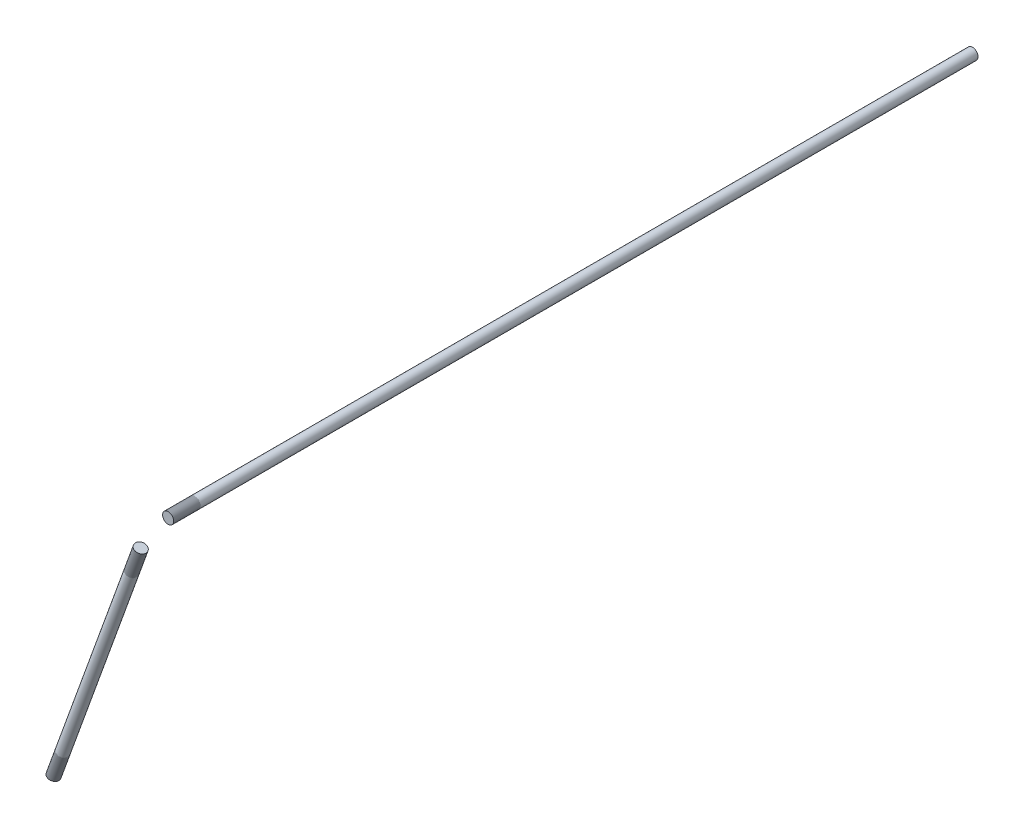
ISO-10303-21;
HEADER;
FILE_DESCRIPTION(('STEP AP214'),'2;1');
FILE_NAME('part.step','',(''),(''),'','','');
FILE_SCHEMA(('AUTOMOTIVE_DESIGN { 1 0 10303 214 1 1 1 1 }'));
ENDSEC;
DATA;
#1=APPLICATION_CONTEXT('core data for automotive mechanical design processes');
#2=APPLICATION_PROTOCOL_DEFINITION('international standard','automotive_design',2000,#1);
#3=PRODUCT_CONTEXT('',#1,'mechanical');
#4=PRODUCT('Part','Part','',(#3));
#5=PRODUCT_RELATED_PRODUCT_CATEGORY('part','',(#4));
#6=PRODUCT_DEFINITION_FORMATION('','',#4);
#7=PRODUCT_DEFINITION_CONTEXT('part definition',#1,'design');
#8=PRODUCT_DEFINITION('design','',#6,#7);
#9=PRODUCT_DEFINITION_SHAPE('','',#8);
#10=(LENGTH_UNIT() NAMED_UNIT(*) SI_UNIT(.MILLI.,.METRE.));
#11=(NAMED_UNIT(*) PLANE_ANGLE_UNIT() SI_UNIT($,.RADIAN.));
#12=(NAMED_UNIT(*) SI_UNIT($,.STERADIAN.) SOLID_ANGLE_UNIT());
#13=UNCERTAINTY_MEASURE_WITH_UNIT(LENGTH_MEASURE(1.E-05),#10,'distance_accuracy_value','');
#14=(GEOMETRIC_REPRESENTATION_CONTEXT(3) GLOBAL_UNCERTAINTY_ASSIGNED_CONTEXT((#13)) GLOBAL_UNIT_ASSIGNED_CONTEXT((#10,
#11,#12)) REPRESENTATION_CONTEXT('',''));
#15=CARTESIAN_POINT('',(0.,0.,0.));
#16=DIRECTION('',(0.,0.,1.));
#17=DIRECTION('',(1.,0.,0.));
#18=AXIS2_PLACEMENT_3D('',#15,#16,#17);
#19=CARTESIAN_POINT('',(-53.7637423435528,-148.467494196321,-8.21634173159548E-13));
#20=DIRECTION('',(-0.340487388896367,-0.940249082957561,0.));
#21=DIRECTION('',(0.940249082957561,-0.340487388896367,0.));
#22=AXIS2_PLACEMENT_3D('',#19,#20,#21);
#23=PLANE('',#22);
#24=CARTESIAN_POINT('',(-53.7637423435593,-148.467494196321,456.160294763652));
#25=DIRECTION('',(-0.340487388896367,-0.940249082957561,0.));
#26=DIRECTION('',(0.940249082957561,-0.340487388896367,0.));
#27=AXIS2_PLACEMENT_3D('',#24,#25,#26);
#28=CIRCLE('',#27,3.17499999999998);
#29=CARTESIAN_POINT('',(-50.7784515051691,-149.548541656067,456.160294763652));
#30=VERTEX_POINT('',#29);
#31=EDGE_CURVE('E11',#30,#30,#28,.F.);
#32=ORIENTED_EDGE('',*,*,#31,.F.);
#33=EDGE_LOOP('',(#32));
#34=FACE_BOUND('',#33,.T.);
#35=ADVANCED_FACE('F44',(#34),#23,.T.);
#36=CARTESIAN_POINT('',(-3.978254651872,-10.9858702852756,456.160294763653));
#37=DIRECTION('',(0.340487388896365,0.940249082957561,0.));
#38=DIRECTION('',(-0.940249082957561,0.340487388896365,0.));
#39=AXIS2_PLACEMENT_3D('',#36,#37,#38);
#40=PLANE('',#39);
#41=CARTESIAN_POINT('',(-3.978254651872,-10.9858702852756,456.160294763653));
#42=DIRECTION('',(0.340487388896365,0.940249082957561,0.));
#43=DIRECTION('',(-0.940249082957561,0.340487388896365,0.));
#44=AXIS2_PLACEMENT_3D('',#41,#42,#43);
#45=CIRCLE('',#44,3.17499999999998);
#46=CARTESIAN_POINT('',(-6.96354549026225,-9.90482282552968,456.160294763653));
#47=VERTEX_POINT('',#46);
#48=EDGE_CURVE('E50',#47,#47,#45,.T.);
#49=ORIENTED_EDGE('',*,*,#48,.T.);
#50=EDGE_LOOP('',(#49));
#51=FACE_BOUND('',#50,.T.);
#52=ADVANCED_FACE('F56',(#51),#40,.T.);
#53=CARTESIAN_POINT('',(-56.8214063018427,-156.91117177888,456.160294763652));
#54=DIRECTION('',(0.340487388896365,0.940249082957561,0.));
#55=DIRECTION('',(-0.940249082957561,0.340487388896365,0.));
#56=AXIS2_PLACEMENT_3D('',#53,#54,#55);
#57=CYLINDRICAL_SURFACE('',#56,3.17499999999998);
#58=ORIENTED_EDGE('',*,*,#48,.F.);
#59=EDGE_LOOP('',(#58));
#60=FACE_BOUND('',#59,.T.);
#61=ORIENTED_EDGE('',*,*,#31,.T.);
#62=EDGE_LOOP('',(#61));
#63=FACE_BOUND('',#62,.T.);
#64=ADVANCED_FACE('F58',(#60,#63),#57,.T.);
#65=CLOSED_SHELL('',(#35,#52,#64));
#66=MANIFOLD_SOLID_BREP('B2',#65);
#67=CARTESIAN_POINT('',(-9.1335169643512E-12,3.30747181677705E-12,444.476294763653));
#68=DIRECTION('',(0.,0.,1.));
#69=DIRECTION('',(1.,0.,0.));
#70=AXIS2_PLACEMENT_3D('',#67,#68,#69);
#71=PLANE('',#70);
#72=CARTESIAN_POINT('',(-3.23951446827215E-13,1.91282277543247E-13,444.476294763653));
#73=DIRECTION('',(0.,0.,1.));
#74=DIRECTION('',(1.,0.,0.));
#75=AXIS2_PLACEMENT_3D('',#72,#73,#74);
#76=CIRCLE('',#75,3.17499999999998);
#77=CARTESIAN_POINT('',(-3.1750000000003,1.91282277543247E-13,444.476294763653));
#78=VERTEX_POINT('',#77);
#79=EDGE_CURVE('E43',#78,#78,#76,.F.);
#80=ORIENTED_EDGE('',*,*,#79,.F.);
#81=EDGE_LOOP('',(#80));
#82=FACE_BOUND('',#81,.T.);
#83=ADVANCED_FACE('F93',(#82),#71,.T.);
#84=CARTESIAN_POINT('',(0.,0.,-15.24));
#85=DIRECTION('',(0.,0.,-1.));
#86=DIRECTION('',(-1.,0.,0.));
#87=AXIS2_PLACEMENT_3D('',#84,#85,#86);
#88=PLANE('',#87);
#89=CARTESIAN_POINT('',(0.,0.,-15.24));
#90=DIRECTION('',(0.,0.,-1.));
#91=DIRECTION('',(-1.,0.,0.));
#92=AXIS2_PLACEMENT_3D('',#89,#90,#91);
#93=CIRCLE('',#92,3.17499999999998);
#94=CARTESIAN_POINT('',(-3.17500000000001,0.,-15.24));
#95=VERTEX_POINT('',#94);
#96=EDGE_CURVE('E99',#95,#95,#93,.T.);
#97=ORIENTED_EDGE('',*,*,#96,.T.);
#98=EDGE_LOOP('',(#97));
#99=FACE_BOUND('',#98,.T.);
#100=ADVANCED_FACE('F105',(#99),#88,.T.);
#101=CARTESIAN_POINT('',(-3.296757422495E-13,1.94348864376614E-13,453.456550884722));
#102=DIRECTION('',(0.,0.,-1.));
#103=DIRECTION('',(-1.,0.,0.));
#104=AXIS2_PLACEMENT_3D('',#101,#102,#103);
#105=CYLINDRICAL_SURFACE('',#104,3.17499999999998);
#106=CARTESIAN_POINT('',(-3.17500000000001,0.,-15.24));
#107=CARTESIAN_POINT('',(-3.17500000000001,0.,-10.451288596212));
#108=CARTESIAN_POINT('',(-3.17500000000001,0.,-5.66257719242392));
#109=CARTESIAN_POINT('',(-3.17500000000002,0.,3.91484561515219));
#110=CARTESIAN_POINT('',(-3.17500000000002,0.,8.70355701894023));
#111=CARTESIAN_POINT('',(-3.17500000000003,0.,18.2809798265163));
#112=CARTESIAN_POINT('',(-3.17500000000003,0.,23.0696912303044));
#113=CARTESIAN_POINT('',(-3.17500000000004,0.,32.6471140378805));
#114=CARTESIAN_POINT('',(-3.17500000000004,0.,37.4358254416685));
#115=CARTESIAN_POINT('',(-3.17500000000005,0.,47.0132482492446));
#116=CARTESIAN_POINT('',(-3.17500000000005,0.,51.8019596530327));
#117=CARTESIAN_POINT('',(-3.17500000000006,0.,61.3793824606088));
#118=CARTESIAN_POINT('',(-3.17500000000006,0.,66.1680938643969));
#119=CARTESIAN_POINT('',(-3.17500000000007,0.,75.745516671973));
#120=CARTESIAN_POINT('',(-3.17500000000007,0.,80.534228075761));
#121=CARTESIAN_POINT('',(-3.17500000000007,0.,90.1116508833371));
#122=CARTESIAN_POINT('',(-3.17500000000008,0.,94.9003622871252));
#123=CARTESIAN_POINT('',(-3.17500000000008,0.,104.477785094701));
#124=CARTESIAN_POINT('',(-3.17500000000009,0.,109.266496498489));
#125=CARTESIAN_POINT('',(-3.17500000000009,0.,118.843919306065));
#126=CARTESIAN_POINT('',(-3.1750000000001,0.,123.632630709853));
#127=CARTESIAN_POINT('',(-3.1750000000001,0.,133.21005351743));
#128=CARTESIAN_POINT('',(-3.1750000000001,0.,137.998764921218));
#129=CARTESIAN_POINT('',(-3.17500000000011,0.,147.576187728794));
#130=CARTESIAN_POINT('',(-3.17500000000011,0.,152.364899132582));
#131=CARTESIAN_POINT('',(-3.17500000000012,0.,161.942321940158));
#132=CARTESIAN_POINT('',(-3.17500000000012,0.,166.731033343946));
#133=CARTESIAN_POINT('',(-3.17500000000013,0.,176.308456151522));
#134=CARTESIAN_POINT('',(-3.17500000000013,1.01343310013602E-13,181.09716755531));
#135=CARTESIAN_POINT('',(-3.17500000000014,1.04613817923771E-13,190.674590362886));
#136=CARTESIAN_POINT('',(-3.17500000000014,1.06249071878856E-13,195.463301766674));
#137=CARTESIAN_POINT('',(-3.17500000000015,1.09519579789025E-13,205.04072457425));
#138=CARTESIAN_POINT('',(-3.17500000000015,1.11154833744109E-13,209.829435978038));
#139=CARTESIAN_POINT('',(-3.17500000000016,1.14425341654278E-13,219.406858785615));
#140=CARTESIAN_POINT('',(-3.17500000000016,1.16060595609362E-13,224.195570189403));
#141=CARTESIAN_POINT('',(-3.17500000000017,1.19331103519531E-13,233.772992996979));
#142=CARTESIAN_POINT('',(-3.17500000000017,1.20966357474616E-13,238.561704400767));
#143=CARTESIAN_POINT('',(-3.17500000000018,1.24236865384785E-13,248.139127208343));
#144=CARTESIAN_POINT('',(-3.17500000000018,1.25872119339869E-13,252.927838612131));
#145=CARTESIAN_POINT('',(-3.17500000000018,1.29142627250038E-13,262.505261419707));
#146=CARTESIAN_POINT('',(-3.17500000000019,1.30777881205122E-13,267.293972823495));
#147=CARTESIAN_POINT('',(-3.17500000000019,1.34048389115291E-13,276.871395631071));
#148=CARTESIAN_POINT('',(-3.1750000000002,1.35683643070376E-13,281.660107034859));
#149=CARTESIAN_POINT('',(-3.1750000000002,1.38954150980545E-13,291.237529842435));
#150=CARTESIAN_POINT('',(-3.17500000000021,1.40589404935629E-13,296.026241246223));
#151=CARTESIAN_POINT('',(-3.17500000000021,1.43859912845798E-13,305.603664053799));
#152=CARTESIAN_POINT('',(-3.17500000000021,1.45495166800882E-13,310.392375457588));
#153=CARTESIAN_POINT('',(-3.17500000000022,1.48765674711051E-13,319.969798265164));
#154=CARTESIAN_POINT('',(-3.17500000000022,1.50400928666136E-13,324.758509668952));
#155=CARTESIAN_POINT('',(-3.17500000000023,1.53671436576305E-13,334.335932476528));
#156=CARTESIAN_POINT('',(-3.17500000000023,1.55306690531389E-13,339.124643880316));
#157=CARTESIAN_POINT('',(-3.17500000000024,1.58577198441558E-13,348.702066687892));
#158=CARTESIAN_POINT('',(-3.17500000000024,1.60212452396642E-13,353.49077809168));
#159=CARTESIAN_POINT('',(-3.17500000000025,1.63482960306811E-13,363.068200899256));
#160=CARTESIAN_POINT('',(-3.17500000000025,1.65118214261896E-13,367.856912303044));
#161=CARTESIAN_POINT('',(-3.17500000000026,1.68388722172065E-13,377.43433511062));
#162=CARTESIAN_POINT('',(-3.17500000000026,1.70023976127149E-13,382.223046514408));
#163=CARTESIAN_POINT('',(-3.17500000000027,1.73294484037318E-13,391.800469321984));
#164=CARTESIAN_POINT('',(-3.17500000000027,1.74929737992402E-13,396.589180725772));
#165=CARTESIAN_POINT('',(-3.17500000000028,1.78200245902571E-13,406.166603533349));
#166=CARTESIAN_POINT('',(-3.17500000000028,1.79835499857656E-13,410.955314937137));
#167=CARTESIAN_POINT('',(-3.17500000000029,1.83106007767825E-13,420.532737744713));
#168=CARTESIAN_POINT('',(-3.17500000000029,1.84741261722909E-13,425.321449148501));
#169=CARTESIAN_POINT('',(-3.17500000000029,1.88011769633078E-13,434.898871956077));
#170=CARTESIAN_POINT('',(-3.1750000000003,1.89647023588162E-13,439.687583359865));
#171=CARTESIAN_POINT('',(-3.1750000000003,1.91282277543247E-13,444.476294763653));
#172=B_SPLINE_CURVE_WITH_KNOTS('',3,(#106,#107,#108,#109,#110,#111,#112,#113,#114,#115,#116,
#117,#118,#119,#120,#121,#122,#123,#124,#125,#126,#127,#128,#129,#130,#131,#132,#133,#134,#135,
#136,#137,#138,#139,#140,#141,#142,#143,#144,#145,#146,#147,#148,#149,#150,#151,#152,#153,#154,
#155,#156,#157,#158,#159,#160,#161,#162,#163,#164,#165,#166,#167,#168,#169,#170,#171),
.UNSPECIFIED.,.F.,.F.,(4,2,2,2,2,2,2,2,2,2,2,2,2,2,2,2,2,2,2,2,2,2,2,2,2,2,2,2,2,2,2,2,4),(0.,
14.3661342113642,28.7322684227283,43.0984026340925,57.4645368454566,71.8306710568208,
86.196805268185,100.562939479549,114.929073690913,129.295207902277,143.661342113642,
158.027476325006,172.39361053637,186.759744747734,201.125878959098,215.492013170462,
229.858147381827,244.224281593191,258.590415804555,272.956550015919,287.322684227283,
301.688818438647,316.054952650012,330.421086861376,344.78722107274,359.153355284104,
373.519489495468,387.885623706832,402.251757918196,416.617892129561,430.984026340925,
445.350160552289,459.716294763653),.UNSPECIFIED.);
#173=EDGE_CURVE('BSEAM107',#95,#78,#172,.T.);
#174=ORIENTED_EDGE('',*,*,#96,.F.);
#175=ORIENTED_EDGE('',*,*,#79,.T.);
#176=ORIENTED_EDGE('',*,*,#173,.T.);
#177=ORIENTED_EDGE('',*,*,#173,.F.);
#178=EDGE_LOOP('',(#174,#176,#175,#177));
#179=FACE_BOUND('',#178,.T.);
#180=ADVANCED_FACE('F107',(#179),#105,.T.);
#181=CLOSED_SHELL('',(#83,#100,#180));
#182=MANIFOLD_SOLID_BREP('B6',#181);
#183=CARTESIAN_POINT('',(-51.1692284401681,-141.302796184185,456.160294763653));
#184=DIRECTION('',(-0.340487388896365,-0.940249082957562,0.));
#185=DIRECTION('',(0.,0.,-1.));
#186=AXIS2_PLACEMENT_3D('',#183,#184,#185);
#187=CYLINDRICAL_SURFACE('',#186,3.175);
#188=CARTESIAN_POINT('',(-48.5747145367778,-134.138098172048,456.160294763653));
#189=DIRECTION('',(-0.340487388896365,-0.940249082957562,0.));
#190=DIRECTION('',(0.,0.,-1.));
#191=AXIS2_PLACEMENT_3D('',#188,#189,#190);
#192=CIRCLE('',#191,3.175);
#193=CARTESIAN_POINT('',(-48.5747145367778,-134.138098172048,452.985294763653));
#194=VERTEX_POINT('',#193);
#195=EDGE_CURVE('E146',#194,#194,#192,.T.);
#196=ORIENTED_EDGE('',*,*,#195,.F.);
#197=EDGE_LOOP('',(#196));
#198=FACE_BOUND('',#197,.T.);
#199=CARTESIAN_POINT('',(-53.7637423435584,-148.467494196321,456.160294763653));
#200=DIRECTION('',(-0.340487388896365,-0.940249082957562,0.));
#201=DIRECTION('',(0.,0.,-1.));
#202=AXIS2_PLACEMENT_3D('',#199,#200,#201);
#203=CIRCLE('',#202,3.175);
#204=CARTESIAN_POINT('',(-53.7637423435584,-148.467494196321,452.985294763653));
#205=VERTEX_POINT('',#204);
#206=EDGE_CURVE('E92',#205,#205,#203,.F.);
#207=ORIENTED_EDGE('',*,*,#206,.F.);
#208=EDGE_LOOP('',(#207));
#209=FACE_BOUND('',#208,.T.);
#210=ADVANCED_FACE('F142',(#198,#209),#187,.F.);
#211=OPEN_SHELL('',(#210));
#212=SHELL_BASED_SURFACE_MODEL('B38',(#211));
#213=CARTESIAN_POINT('',(-6.55403770319105E-12,5.88203118828181E-13,436.856294763653));
#214=DIRECTION('',(0.,0.,1.));
#215=DIRECTION('',(-0.340487388896365,-0.940249082957562,0.));
#216=AXIS2_PLACEMENT_3D('',#213,#214,#215);
#217=CYLINDRICAL_SURFACE('',#216,3.175);
#218=CARTESIAN_POINT('',(-6.43929354282591E-12,5.82867087928207E-13,429.236294763653));
#219=DIRECTION('',(0.,0.,1.));
#220=DIRECTION('',(-0.340487388896365,-0.940249082957562,0.));
#221=AXIS2_PLACEMENT_3D('',#218,#219,#220);
#222=CIRCLE('',#221,3.175);
#223=CARTESIAN_POINT('',(-1.0810474597524,-2.98529083838968,429.236294763653));
#224=VERTEX_POINT('',#223);
#225=EDGE_CURVE('E194',#224,#224,#222,.T.);
#226=ORIENTED_EDGE('',*,*,#225,.F.);
#227=EDGE_LOOP('',(#226));
#228=FACE_BOUND('',#227,.T.);
#229=CARTESIAN_POINT('',(-6.6687818635562E-12,5.93539149728155E-13,444.476294763653));
#230=DIRECTION('',(0.,0.,1.));
#231=DIRECTION('',(-0.340487388896365,-0.940249082957562,0.));
#232=AXIS2_PLACEMENT_3D('',#229,#230,#231);
#233=CIRCLE('',#232,3.175);
#234=CARTESIAN_POINT('',(-1.08104745975263,-2.98529083838966,444.476294763653));
#235=VERTEX_POINT('',#234);
#236=EDGE_CURVE('E141',#235,#235,#233,.F.);
#237=ORIENTED_EDGE('',*,*,#236,.F.);
#238=EDGE_LOOP('',(#237));
#239=FACE_BOUND('',#238,.T.);
#240=ADVANCED_FACE('F190',(#228,#239),#217,.F.);
#241=OPEN_SHELL('',(#240));
#242=SHELL_BASED_SURFACE_MODEL('B87',(#241));
#243=CARTESIAN_POINT('',(-6.57276855526228,-18.1505682974122,456.160294763653));
#244=DIRECTION('',(0.340487388896365,0.940249082957562,0.));
#245=DIRECTION('',(0.,0.,1.));
#246=AXIS2_PLACEMENT_3D('',#243,#244,#245);
#247=CYLINDRICAL_SURFACE('',#246,3.175);
#248=CARTESIAN_POINT('',(-9.16728245865258,-25.3152663095488,456.160294763653));
#249=DIRECTION('',(0.340487388896365,0.940249082957562,0.));
#250=DIRECTION('',(0.,0.,1.));
#251=AXIS2_PLACEMENT_3D('',#248,#249,#250);
#252=CIRCLE('',#251,3.175);
#253=CARTESIAN_POINT('',(-9.16728245865263,-25.3152663095488,459.335294763653));
#254=VERTEX_POINT('',#253);
#255=EDGE_CURVE('E189',#254,#254,#252,.T.);
#256=ORIENTED_EDGE('',*,*,#255,.F.);
#257=EDGE_LOOP('',(#256));
#258=FACE_BOUND('',#257,.T.);
#259=CARTESIAN_POINT('',(-3.97825465187198,-10.9858702852755,456.160294763653));
#260=DIRECTION('',(0.340487388896365,0.940249082957562,0.));
#261=DIRECTION('',(0.,0.,1.));
#262=AXIS2_PLACEMENT_3D('',#259,#260,#261);
#263=CIRCLE('',#262,3.175);
#264=CARTESIAN_POINT('',(-3.97825465187202,-10.9858702852755,459.335294763653));
#265=VERTEX_POINT('',#264);
#266=EDGE_CURVE('E241',#265,#265,#263,.F.);
#267=ORIENTED_EDGE('',*,*,#266,.F.);
#268=EDGE_LOOP('',(#267));
#269=FACE_BOUND('',#268,.T.);
#270=ADVANCED_FACE('F237',(#258,#269),#247,.F.);
#271=OPEN_SHELL('',(#270));
#272=SHELL_BASED_SURFACE_MODEL('B136',(#271));
#273=CARTESIAN_POINT('',(-6.55403770319105E-12,5.88203118828181E-13,436.856294763653));
#274=DIRECTION('',(0.,0.,1.));
#275=DIRECTION('',(-0.340487388896365,-0.940249082957562,0.));
#276=AXIS2_PLACEMENT_3D('',#273,#274,#275);
#277=CYLINDRICAL_SURFACE('',#276,3.175);
#278=CARTESIAN_POINT('',(-6.43929354282591E-12,5.82867087928207E-13,429.236294763653));
#279=DIRECTION('',(0.,0.,1.));
#280=DIRECTION('',(-0.340487388896365,-0.940249082957562,0.));
#281=AXIS2_PLACEMENT_3D('',#278,#279,#280);
#282=CIRCLE('',#281,3.175);
#283=CARTESIAN_POINT('',(-1.0810474597524,-2.98529083838968,429.236294763653));
#284=VERTEX_POINT('',#283);
#285=EDGE_CURVE('E277',#284,#284,#282,.T.);
#286=ORIENTED_EDGE('',*,*,#285,.F.);
#287=EDGE_LOOP('',(#286));
#288=FACE_BOUND('',#287,.T.);
#289=CARTESIAN_POINT('',(-6.6687818635562E-12,5.93539149728155E-13,444.476294763653));
#290=DIRECTION('',(0.,0.,1.));
#291=DIRECTION('',(-0.340487388896365,-0.940249082957562,0.));
#292=AXIS2_PLACEMENT_3D('',#289,#290,#291);
#293=CIRCLE('',#292,3.175);
#294=CARTESIAN_POINT('',(-1.08104745975263,-2.98529083838966,444.476294763653));
#295=VERTEX_POINT('',#294);
#296=EDGE_CURVE('E236',#295,#295,#293,.F.);
#297=ORIENTED_EDGE('',*,*,#296,.F.);
#298=EDGE_LOOP('',(#297));
#299=FACE_BOUND('',#298,.T.);
#300=ADVANCED_FACE('F273',(#288,#299),#277,.F.);
#301=OPEN_SHELL('',(#300));
#302=SHELL_BASED_SURFACE_MODEL('B184',(#301));
#303=CARTESIAN_POINT('',(0.,0.,-7.62));
#304=DIRECTION('',(0.,0.,-1.));
#305=DIRECTION('',(-1.,0.,0.));
#306=AXIS2_PLACEMENT_3D('',#303,#304,#305);
#307=CYLINDRICAL_SURFACE('',#306,3.175);
#308=CARTESIAN_POINT('',(0.,0.,-15.24));
#309=DIRECTION('',(0.,0.,-1.));
#310=DIRECTION('',(-1.,0.,0.));
#311=AXIS2_PLACEMENT_3D('',#308,#309,#310);
#312=CIRCLE('',#311,3.175);
#313=CARTESIAN_POINT('',(-3.17500000000003,0.,-15.24));
#314=VERTEX_POINT('',#313);
#315=EDGE_CURVE('E318',#314,#314,#312,.T.);
#316=ORIENTED_EDGE('',*,*,#315,.T.);
#317=EDGE_LOOP('',(#316));
#318=FACE_BOUND('',#317,.T.);
#319=CARTESIAN_POINT('',(0.,0.,0.));
#320=DIRECTION('',(0.,0.,-1.));
#321=DIRECTION('',(-1.,0.,0.));
#322=AXIS2_PLACEMENT_3D('',#319,#320,#321);
#323=CIRCLE('',#322,3.175);
#324=CARTESIAN_POINT('',(-3.17500000000004,0.,0.));
#325=VERTEX_POINT('',#324);
#326=EDGE_CURVE('E272',#325,#325,#323,.T.);
#327=ORIENTED_EDGE('',*,*,#326,.F.);
#328=EDGE_LOOP('',(#327));
#329=FACE_BOUND('',#328,.T.);
#330=ADVANCED_FACE('F314',(#318,#329),#307,.F.);
#331=OPEN_SHELL('',(#330));
#332=SHELL_BASED_SURFACE_MODEL('B231',(#331));
#333=ADVANCED_BREP_SHAPE_REPRESENTATION('',(#18,#66,#182),#14);
#334=MANIFOLD_SURFACE_SHAPE_REPRESENTATION('',(#18,#212,#242,#272,#302,#332),#14);
#335=SHAPE_REPRESENTATION('',(#18),#14);
#336=SHAPE_DEFINITION_REPRESENTATION(#9,#335);
#337=SHAPE_REPRESENTATION_RELATIONSHIP('','',#335,#333);
#338=SHAPE_REPRESENTATION_RELATIONSHIP('','',#335,#334);
ENDSEC;
END-ISO-10303-21;
